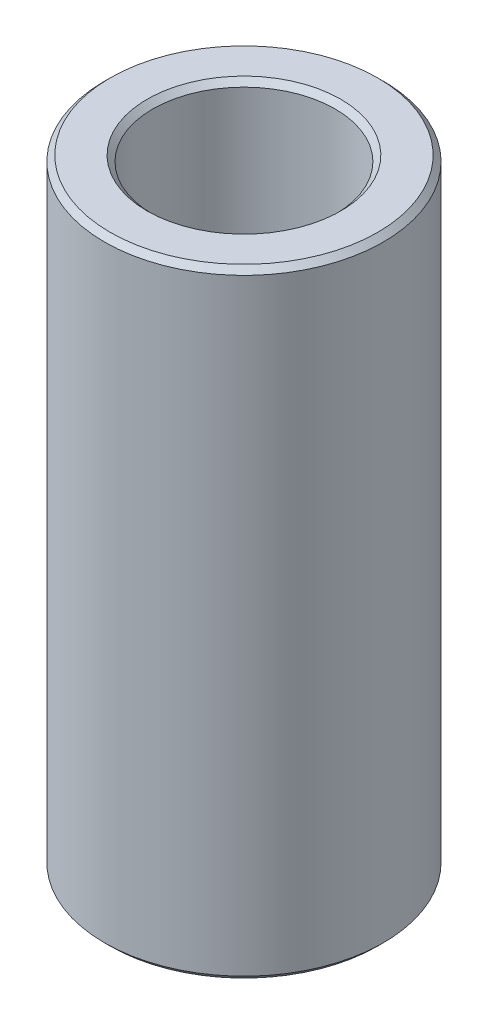
ISO-10303-21;
HEADER;
FILE_DESCRIPTION(('STEP AP214'),'2;1');
FILE_NAME('part.step','',(''),(''),'','','');
FILE_SCHEMA(('AUTOMOTIVE_DESIGN { 1 0 10303 214 1 1 1 1 }'));
ENDSEC;
DATA;
#1=APPLICATION_CONTEXT('core data for automotive mechanical design processes');
#2=APPLICATION_PROTOCOL_DEFINITION('international standard','automotive_design',2000,#1);
#3=PRODUCT_CONTEXT('',#1,'mechanical');
#4=PRODUCT('Part','Part','',(#3));
#5=PRODUCT_RELATED_PRODUCT_CATEGORY('part','',(#4));
#6=PRODUCT_DEFINITION_FORMATION('','',#4);
#7=PRODUCT_DEFINITION_CONTEXT('part definition',#1,'design');
#8=PRODUCT_DEFINITION('design','',#6,#7);
#9=PRODUCT_DEFINITION_SHAPE('','',#8);
#10=(LENGTH_UNIT() NAMED_UNIT(*) SI_UNIT(.MILLI.,.METRE.));
#11=(NAMED_UNIT(*) PLANE_ANGLE_UNIT() SI_UNIT($,.RADIAN.));
#12=(NAMED_UNIT(*) SI_UNIT($,.STERADIAN.) SOLID_ANGLE_UNIT());
#13=UNCERTAINTY_MEASURE_WITH_UNIT(LENGTH_MEASURE(1.E-05),#10,'distance_accuracy_value','');
#14=(GEOMETRIC_REPRESENTATION_CONTEXT(3) GLOBAL_UNCERTAINTY_ASSIGNED_CONTEXT((#13)) GLOBAL_UNIT_ASSIGNED_CONTEXT((#10,
#11,#12)) REPRESENTATION_CONTEXT('',''));
#15=CARTESIAN_POINT('',(0.,0.,0.));
#16=DIRECTION('',(0.,0.,1.));
#17=DIRECTION('',(1.,0.,0.));
#18=AXIS2_PLACEMENT_3D('',#15,#16,#17);
#19=CARTESIAN_POINT('',(0.,210.644641932684,0.));
#20=DIRECTION('',(0.,-1.,0.));
#21=DIRECTION('',(0.,0.,-1.));
#22=AXIS2_PLACEMENT_3D('',#19,#20,#21);
#23=CYLINDRICAL_SURFACE('',#22,47.5);
#24=CARTESIAN_POINT('',(0.,1.91357127369549,0.));
#25=DIRECTION('',(0.,1.,0.));
#26=DIRECTION('',(0.,0.,1.));
#27=AXIS2_PLACEMENT_3D('',#24,#25,#26);
#28=CIRCLE('',#27,47.5);
#29=CARTESIAN_POINT('',(0.,1.91357127369549,47.5));
#30=VERTEX_POINT('',#29);
#31=EDGE_CURVE('E10',#30,#30,#28,.T.);
#32=ORIENTED_EDGE('',*,*,#31,.T.);
#33=EDGE_LOOP('',(#32));
#34=FACE_BOUND('',#33,.T.);
#35=CARTESIAN_POINT('',(0.,208.731070658988,0.));
#36=DIRECTION('',(0.,1.,0.));
#37=DIRECTION('',(0.,0.,1.));
#38=AXIS2_PLACEMENT_3D('',#35,#36,#37);
#39=CIRCLE('',#38,47.5);
#40=CARTESIAN_POINT('',(0.,208.731070658988,47.5));
#41=VERTEX_POINT('',#40);
#42=EDGE_CURVE('E50',#41,#41,#39,.F.);
#43=ORIENTED_EDGE('',*,*,#42,.T.);
#44=EDGE_LOOP('',(#43));
#45=FACE_BOUND('',#44,.T.);
#46=ADVANCED_FACE('F39',(#34,#45),#23,.T.);
#47=CARTESIAN_POINT('',(0.,210.644641932684,0.));
#48=DIRECTION('',(0.,1.,0.));
#49=DIRECTION('',(0.,0.,1.));
#50=AXIS2_PLACEMENT_3D('',#47,#48,#49);
#51=PLANE('',#50);
#52=CARTESIAN_POINT('',(0.,210.644641932684,0.));
#53=DIRECTION('',(0.,1.,0.));
#54=DIRECTION('',(0.,0.,1.));
#55=AXIS2_PLACEMENT_3D('',#52,#53,#54);
#56=CIRCLE('',#55,32.9956375010897);
#57=CARTESIAN_POINT('',(0.,210.644641932684,32.9956375010897));
#58=VERTEX_POINT('',#57);
#59=EDGE_CURVE('E58',#58,#58,#56,.F.);
#60=ORIENTED_EDGE('',*,*,#59,.T.);
#61=EDGE_LOOP('',(#60));
#62=FACE_BOUND('',#61,.T.);
#63=CARTESIAN_POINT('',(0.,210.644641932684,0.));
#64=DIRECTION('',(0.,1.,0.));
#65=DIRECTION('',(0.,0.,1.));
#66=AXIS2_PLACEMENT_3D('',#63,#64,#65);
#67=CIRCLE('',#66,45.5864287263046);
#68=CARTESIAN_POINT('',(0.,210.644641932684,45.5864287263046));
#69=VERTEX_POINT('',#68);
#70=EDGE_CURVE('E61',#69,#69,#67,.T.);
#71=ORIENTED_EDGE('',*,*,#70,.T.);
#72=EDGE_LOOP('',(#71));
#73=FACE_BOUND('',#72,.T.);
#74=ADVANCED_FACE('F88',(#62,#73),#51,.T.);
#75=CARTESIAN_POINT('',(0.,0.,0.));
#76=DIRECTION('',(0.,1.,0.));
#77=DIRECTION('',(0.,0.,1.));
#78=AXIS2_PLACEMENT_3D('',#75,#76,#77);
#79=PLANE('',#78);
#80=CARTESIAN_POINT('',(0.,0.,0.));
#81=DIRECTION('',(0.,1.,0.));
#82=DIRECTION('',(0.,0.,1.));
#83=AXIS2_PLACEMENT_3D('',#80,#81,#82);
#84=CIRCLE('',#83,32.9956375010897);
#85=CARTESIAN_POINT('',(0.,0.,32.9956375010897));
#86=VERTEX_POINT('',#85);
#87=EDGE_CURVE('E51',#86,#86,#84,.T.);
#88=ORIENTED_EDGE('',*,*,#87,.T.);
#89=EDGE_LOOP('',(#88));
#90=FACE_BOUND('',#89,.T.);
#91=CARTESIAN_POINT('',(0.,0.,0.));
#92=DIRECTION('',(0.,1.,0.));
#93=DIRECTION('',(0.,0.,1.));
#94=AXIS2_PLACEMENT_3D('',#91,#92,#93);
#95=CIRCLE('',#94,45.5864287263045);
#96=CARTESIAN_POINT('',(0.,0.,45.5864287263045));
#97=VERTEX_POINT('',#96);
#98=EDGE_CURVE('E54',#97,#97,#95,.F.);
#99=ORIENTED_EDGE('',*,*,#98,.T.);
#100=EDGE_LOOP('',(#99));
#101=FACE_BOUND('',#100,.T.);
#102=ADVANCED_FACE('F83',(#90,#101),#79,.F.);
#103=CARTESIAN_POINT('',(0.,210.644641932684,0.));
#104=DIRECTION('',(0.,-1.,0.));
#105=DIRECTION('',(0.,0.,-1.));
#106=AXIS2_PLACEMENT_3D('',#103,#104,#105);
#107=CYLINDRICAL_SURFACE('',#106,31.0820662273942);
#108=CARTESIAN_POINT('',(0.,208.731070658988,0.));
#109=DIRECTION('',(0.,1.,0.));
#110=DIRECTION('',(0.,0.,1.));
#111=AXIS2_PLACEMENT_3D('',#108,#109,#110);
#112=CIRCLE('',#111,31.0820662273942);
#113=CARTESIAN_POINT('',(0.,208.731070658988,31.0820662273942));
#114=VERTEX_POINT('',#113);
#115=EDGE_CURVE('E67',#114,#114,#112,.T.);
#116=ORIENTED_EDGE('',*,*,#115,.T.);
#117=EDGE_LOOP('',(#116));
#118=FACE_BOUND('',#117,.T.);
#119=CARTESIAN_POINT('',(0.,1.91357127369551,0.));
#120=DIRECTION('',(0.,1.,0.));
#121=DIRECTION('',(0.,0.,1.));
#122=AXIS2_PLACEMENT_3D('',#119,#120,#121);
#123=CIRCLE('',#122,31.0820662273942);
#124=CARTESIAN_POINT('',(0.,1.91357127369551,31.0820662273942));
#125=VERTEX_POINT('',#124);
#126=EDGE_CURVE('E69',#125,#125,#123,.F.);
#127=ORIENTED_EDGE('',*,*,#126,.T.);
#128=EDGE_LOOP('',(#127));
#129=FACE_BOUND('',#128,.T.);
#130=ADVANCED_FACE('F71',(#118,#129),#107,.F.);
#131=CARTESIAN_POINT('',(0.,208.731070658988,0.));
#132=DIRECTION('',(0.,1.,0.));
#133=DIRECTION('',(0.,0.,1.));
#134=AXIS2_PLACEMENT_3D('',#131,#132,#133);
#135=CONICAL_SURFACE('',#134,31.0820662273942,0.785398163397447);
#136=ORIENTED_EDGE('',*,*,#59,.F.);
#137=EDGE_LOOP('',(#136));
#138=FACE_BOUND('',#137,.T.);
#139=ORIENTED_EDGE('',*,*,#115,.F.);
#140=EDGE_LOOP('',(#139));
#141=FACE_BOUND('',#140,.T.);
#142=ADVANCED_FACE('F77',(#138,#141),#135,.F.);
#143=CARTESIAN_POINT('',(0.,0.,0.));
#144=DIRECTION('',(0.,-1.,0.));
#145=DIRECTION('',(0.,0.,-1.));
#146=AXIS2_PLACEMENT_3D('',#143,#144,#145);
#147=CONICAL_SURFACE('',#146,32.9956375010897,0.78539816339744);
#148=ORIENTED_EDGE('',*,*,#126,.F.);
#149=EDGE_LOOP('',(#148));
#150=FACE_BOUND('',#149,.T.);
#151=ORIENTED_EDGE('',*,*,#87,.F.);
#152=EDGE_LOOP('',(#151));
#153=FACE_BOUND('',#152,.T.);
#154=ADVANCED_FACE('F73',(#150,#153),#147,.F.);
#155=CARTESIAN_POINT('',(0.,1.91357127369549,0.));
#156=DIRECTION('',(0.,1.,0.));
#157=DIRECTION('',(0.,0.,1.));
#158=AXIS2_PLACEMENT_3D('',#155,#156,#157);
#159=CONICAL_SURFACE('',#158,47.5,0.785398163397454);
#160=ORIENTED_EDGE('',*,*,#98,.F.);
#161=EDGE_LOOP('',(#160));
#162=FACE_BOUND('',#161,.T.);
#163=ORIENTED_EDGE('',*,*,#31,.F.);
#164=EDGE_LOOP('',(#163));
#165=FACE_BOUND('',#164,.T.);
#166=ADVANCED_FACE('F76',(#162,#165),#159,.T.);
#167=CARTESIAN_POINT('',(0.,210.644641932684,0.));
#168=DIRECTION('',(0.,-1.,0.));
#169=DIRECTION('',(0.,0.,-1.));
#170=AXIS2_PLACEMENT_3D('',#167,#168,#169);
#171=CONICAL_SURFACE('',#170,45.5864287263046,0.785398163397439);
#172=ORIENTED_EDGE('',*,*,#42,.F.);
#173=EDGE_LOOP('',(#172));
#174=FACE_BOUND('',#173,.T.);
#175=ORIENTED_EDGE('',*,*,#70,.F.);
#176=EDGE_LOOP('',(#175));
#177=FACE_BOUND('',#176,.T.);
#178=ADVANCED_FACE('F45',(#174,#177),#171,.T.);
#179=CLOSED_SHELL('',(#46,#74,#102,#130,#142,#154,#166,#178));
#180=MANIFOLD_SOLID_BREP('B2',#179);
#181=ADVANCED_BREP_SHAPE_REPRESENTATION('',(#18,#180),#14);
#182=SHAPE_DEFINITION_REPRESENTATION(#9,#181);
ENDSEC;
END-ISO-10303-21;
